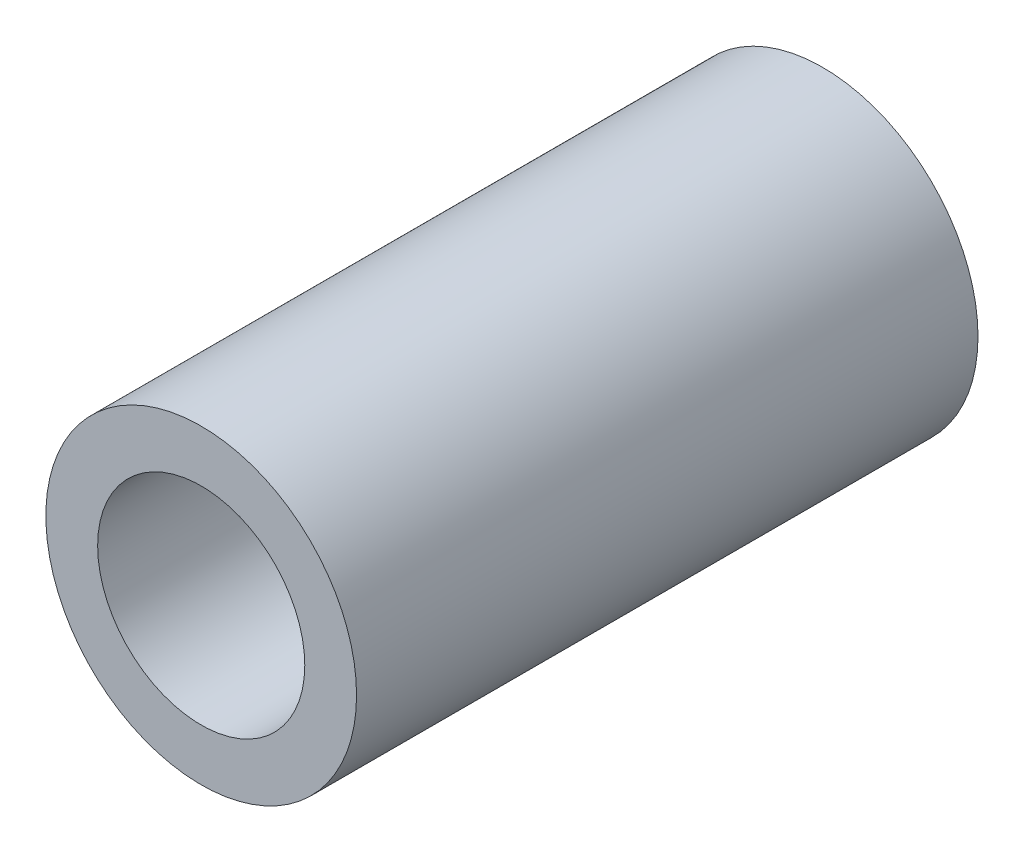
ISO-10303-21;
HEADER;
FILE_DESCRIPTION(('STEP AP214'),'2;1');
FILE_NAME('part.step','',(''),(''),'','','');
FILE_SCHEMA(('AUTOMOTIVE_DESIGN { 1 0 10303 214 1 1 1 1 }'));
ENDSEC;
DATA;
#1=APPLICATION_CONTEXT('core data for automotive mechanical design processes');
#2=APPLICATION_PROTOCOL_DEFINITION('international standard','automotive_design',2000,#1);
#3=PRODUCT_CONTEXT('',#1,'mechanical');
#4=PRODUCT('Part','Part','',(#3));
#5=PRODUCT_RELATED_PRODUCT_CATEGORY('part','',(#4));
#6=PRODUCT_DEFINITION_FORMATION('','',#4);
#7=PRODUCT_DEFINITION_CONTEXT('part definition',#1,'design');
#8=PRODUCT_DEFINITION('design','',#6,#7);
#9=PRODUCT_DEFINITION_SHAPE('','',#8);
#10=(LENGTH_UNIT() NAMED_UNIT(*) SI_UNIT(.MILLI.,.METRE.));
#11=(NAMED_UNIT(*) PLANE_ANGLE_UNIT() SI_UNIT($,.RADIAN.));
#12=(NAMED_UNIT(*) SI_UNIT($,.STERADIAN.) SOLID_ANGLE_UNIT());
#13=UNCERTAINTY_MEASURE_WITH_UNIT(LENGTH_MEASURE(1.E-05),#10,'distance_accuracy_value','');
#14=(GEOMETRIC_REPRESENTATION_CONTEXT(3) GLOBAL_UNCERTAINTY_ASSIGNED_CONTEXT((#13)) GLOBAL_UNIT_ASSIGNED_CONTEXT((#10,
#11,#12)) REPRESENTATION_CONTEXT('',''));
#15=CARTESIAN_POINT('',(0.,0.,0.));
#16=DIRECTION('',(0.,0.,1.));
#17=DIRECTION('',(1.,0.,0.));
#18=AXIS2_PLACEMENT_3D('',#15,#16,#17);
#19=CARTESIAN_POINT('',(0.,0.,19.05));
#20=DIRECTION('',(0.,0.,1.));
#21=DIRECTION('',(1.,0.,0.));
#22=AXIS2_PLACEMENT_3D('',#19,#20,#21);
#23=PLANE('',#22);
#24=CARTESIAN_POINT('',(0.,0.,19.05));
#25=DIRECTION('',(0.,0.,1.));
#26=DIRECTION('',(1.,0.,0.));
#27=AXIS2_PLACEMENT_3D('',#24,#25,#26);
#28=CIRCLE('',#27,4.7625);
#29=CARTESIAN_POINT('',(4.7625,0.,19.05));
#30=VERTEX_POINT('',#29);
#31=EDGE_CURVE('E10',#30,#30,#28,.T.);
#32=ORIENTED_EDGE('',*,*,#31,.T.);
#33=EDGE_LOOP('',(#32));
#34=FACE_BOUND('',#33,.T.);
#35=CARTESIAN_POINT('',(0.,0.,19.05));
#36=DIRECTION('',(0.,0.,1.));
#37=DIRECTION('',(1.,0.,0.));
#38=AXIS2_PLACEMENT_3D('',#35,#36,#37);
#39=CIRCLE('',#38,3.175);
#40=CARTESIAN_POINT('',(3.175,0.,19.05));
#41=VERTEX_POINT('',#40);
#42=EDGE_CURVE('E42',#41,#41,#39,.T.);
#43=ORIENTED_EDGE('',*,*,#42,.F.);
#44=EDGE_LOOP('',(#43));
#45=FACE_BOUND('',#44,.T.);
#46=ADVANCED_FACE('F31',(#34,#45),#23,.T.);
#47=CARTESIAN_POINT('',(0.,0.,0.));
#48=DIRECTION('',(0.,0.,1.));
#49=DIRECTION('',(1.,0.,0.));
#50=AXIS2_PLACEMENT_3D('',#47,#48,#49);
#51=PLANE('',#50);
#52=CARTESIAN_POINT('',(0.,0.,0.));
#53=DIRECTION('',(0.,0.,1.));
#54=DIRECTION('',(1.,0.,0.));
#55=AXIS2_PLACEMENT_3D('',#52,#53,#54);
#56=CIRCLE('',#55,4.7625);
#57=CARTESIAN_POINT('',(4.7625,0.,0.));
#58=VERTEX_POINT('',#57);
#59=EDGE_CURVE('E35',#58,#58,#56,.T.);
#60=ORIENTED_EDGE('',*,*,#59,.F.);
#61=EDGE_LOOP('',(#60));
#62=FACE_BOUND('',#61,.T.);
#63=CARTESIAN_POINT('',(0.,0.,0.));
#64=DIRECTION('',(0.,0.,1.));
#65=DIRECTION('',(1.,0.,0.));
#66=AXIS2_PLACEMENT_3D('',#63,#64,#65);
#67=CIRCLE('',#66,3.175);
#68=CARTESIAN_POINT('',(3.175,0.,0.));
#69=VERTEX_POINT('',#68);
#70=EDGE_CURVE('E44',#69,#69,#67,.T.);
#71=ORIENTED_EDGE('',*,*,#70,.T.);
#72=EDGE_LOOP('',(#71));
#73=FACE_BOUND('',#72,.T.);
#74=ADVANCED_FACE('F54',(#62,#73),#51,.F.);
#75=CARTESIAN_POINT('',(0.,0.,19.05));
#76=DIRECTION('',(0.,0.,-1.));
#77=DIRECTION('',(-1.,0.,0.));
#78=AXIS2_PLACEMENT_3D('',#75,#76,#77);
#79=CYLINDRICAL_SURFACE('',#78,4.7625);
#80=ORIENTED_EDGE('',*,*,#31,.F.);
#81=EDGE_LOOP('',(#80));
#82=FACE_BOUND('',#81,.T.);
#83=ORIENTED_EDGE('',*,*,#59,.T.);
#84=EDGE_LOOP('',(#83));
#85=FACE_BOUND('',#84,.T.);
#86=ADVANCED_FACE('F33',(#82,#85),#79,.T.);
#87=CARTESIAN_POINT('',(0.,0.,19.05));
#88=DIRECTION('',(0.,0.,-1.));
#89=DIRECTION('',(-1.,0.,0.));
#90=AXIS2_PLACEMENT_3D('',#87,#88,#89);
#91=CYLINDRICAL_SURFACE('',#90,3.175);
#92=ORIENTED_EDGE('',*,*,#42,.T.);
#93=EDGE_LOOP('',(#92));
#94=FACE_BOUND('',#93,.T.);
#95=ORIENTED_EDGE('',*,*,#70,.F.);
#96=EDGE_LOOP('',(#95));
#97=FACE_BOUND('',#96,.T.);
#98=ADVANCED_FACE('F50',(#94,#97),#91,.F.);
#99=CLOSED_SHELL('',(#46,#74,#86,#98));
#100=MANIFOLD_SOLID_BREP('B2',#99);
#101=ADVANCED_BREP_SHAPE_REPRESENTATION('',(#18,#100),#14);
#102=SHAPE_DEFINITION_REPRESENTATION(#9,#101);
ENDSEC;
END-ISO-10303-21;
